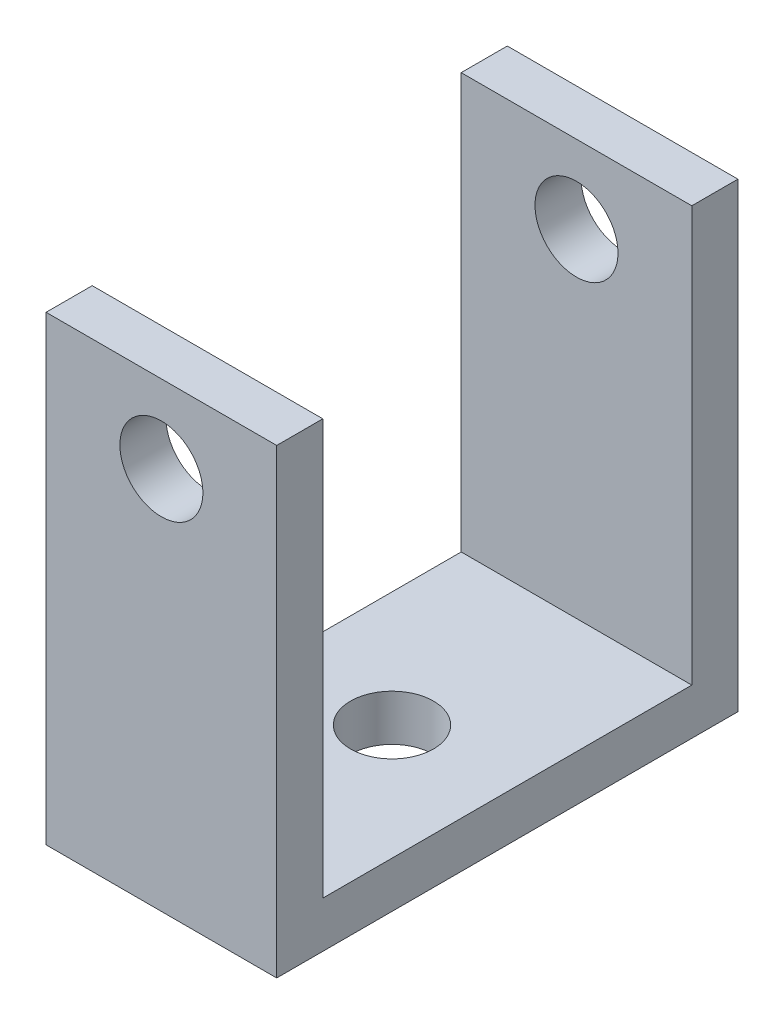
ISO-10303-21;
HEADER;
FILE_DESCRIPTION(('STEP AP214'),'2;1');
FILE_NAME('part.step','',(''),(''),'','','');
FILE_SCHEMA(('AUTOMOTIVE_DESIGN { 1 0 10303 214 1 1 1 1 }'));
ENDSEC;
DATA;
#1=APPLICATION_CONTEXT('core data for automotive mechanical design processes');
#2=APPLICATION_PROTOCOL_DEFINITION('international standard','automotive_design',2000,#1);
#3=PRODUCT_CONTEXT('',#1,'mechanical');
#4=PRODUCT('Part','Part','',(#3));
#5=PRODUCT_RELATED_PRODUCT_CATEGORY('part','',(#4));
#6=PRODUCT_DEFINITION_FORMATION('','',#4);
#7=PRODUCT_DEFINITION_CONTEXT('part definition',#1,'design');
#8=PRODUCT_DEFINITION('design','',#6,#7);
#9=PRODUCT_DEFINITION_SHAPE('','',#8);
#10=(LENGTH_UNIT() NAMED_UNIT(*) SI_UNIT(.MILLI.,.METRE.));
#11=(NAMED_UNIT(*) PLANE_ANGLE_UNIT() SI_UNIT($,.RADIAN.));
#12=(NAMED_UNIT(*) SI_UNIT($,.STERADIAN.) SOLID_ANGLE_UNIT());
#13=UNCERTAINTY_MEASURE_WITH_UNIT(LENGTH_MEASURE(1.E-05),#10,'distance_accuracy_value','');
#14=(GEOMETRIC_REPRESENTATION_CONTEXT(3) GLOBAL_UNCERTAINTY_ASSIGNED_CONTEXT((#13)) GLOBAL_UNIT_ASSIGNED_CONTEXT((#10,
#11,#12)) REPRESENTATION_CONTEXT('',''));
#15=CARTESIAN_POINT('',(0.,0.,0.));
#16=DIRECTION('',(0.,0.,1.));
#17=DIRECTION('',(1.,0.,0.));
#18=AXIS2_PLACEMENT_3D('',#15,#16,#17);
#19=CARTESIAN_POINT('',(6.35000000000003,0.,10.16));
#20=DIRECTION('',(0.,0.,1.));
#21=DIRECTION('',(0.,-1.,0.));
#22=AXIS2_PLACEMENT_3D('',#19,#20,#21);
#23=PLANE('',#22);
#24=CARTESIAN_POINT('',(0.,21.1074000000001,10.1599999999998));
#25=DIRECTION('',(0.,0.,1.));
#26=DIRECTION('',(0.,-1.,0.));
#27=AXIS2_PLACEMENT_3D('',#24,#25,#26);
#28=CIRCLE('',#27,2.286);
#29=CARTESIAN_POINT('',(0.,18.8214000000001,10.1599999999998));
#30=VERTEX_POINT('',#29);
#31=EDGE_CURVE('E136',#30,#30,#28,.T.);
#32=ORIENTED_EDGE('',*,*,#31,.T.);
#33=EDGE_LOOP('',(#32));
#34=FACE_BOUND('',#33,.T.);
#35=DIRECTION('',(0.,1.,0.));
#36=VECTOR('',#35,1.);
#37=CARTESIAN_POINT('',(-6.34999999999998,0.,10.16));
#38=LINE('',#37,#36);
#39=CARTESIAN_POINT('',(-6.35000000000001,2.54,10.16));
#40=VERTEX_POINT('',#39);
#41=CARTESIAN_POINT('',(-6.34999999999997,25.4000000000002,10.1599999999999));
#42=VERTEX_POINT('',#41);
#43=EDGE_CURVE('E132',#40,#42,#38,.T.);
#44=ORIENTED_EDGE('',*,*,#43,.T.);
#45=DIRECTION('',(-1.,0.,0.));
#46=VECTOR('',#45,1.);
#47=CARTESIAN_POINT('',(6.35000000000002,25.4000000000002,10.1599999999999));
#48=LINE('',#47,#46);
#49=CARTESIAN_POINT('',(6.35000000000002,25.4000000000002,10.1599999999999));
#50=VERTEX_POINT('',#49);
#51=EDGE_CURVE('E11',#50,#42,#48,.T.);
#52=ORIENTED_EDGE('',*,*,#51,.F.);
#53=DIRECTION('',(0.,1.,0.));
#54=VECTOR('',#53,1.);
#55=CARTESIAN_POINT('',(6.35000000000003,0.,10.16));
#56=LINE('',#55,#54);
#57=CARTESIAN_POINT('',(6.35000000000004,2.54000000000005,10.1599999999999));
#58=VERTEX_POINT('',#57);
#59=EDGE_CURVE('E90',#58,#50,#56,.T.);
#60=ORIENTED_EDGE('',*,*,#59,.F.);
#61=DIRECTION('',(-1.,0.,0.));
#62=VECTOR('',#61,1.);
#63=CARTESIAN_POINT('',(6.35000000000004,2.54000000000005,10.1599999999999));
#64=LINE('',#63,#62);
#65=EDGE_CURVE('E131',#58,#40,#64,.T.);
#66=ORIENTED_EDGE('',*,*,#65,.T.);
#67=EDGE_LOOP('',(#44,#52,#60,#66));
#68=FACE_BOUND('',#67,.T.);
#69=ADVANCED_FACE('F34',(#34,#68),#23,.F.);
#70=CARTESIAN_POINT('',(6.35000000000002,25.4000000000002,12.6999999999999));
#71=DIRECTION('',(0.,1.,0.));
#72=DIRECTION('',(0.,0.,1.));
#73=AXIS2_PLACEMENT_3D('',#70,#71,#72);
#74=PLANE('',#73);
#75=DIRECTION('',(0.,0.,-1.));
#76=VECTOR('',#75,1.);
#77=CARTESIAN_POINT('',(-6.35000000000002,25.4000000000002,12.6999999999999));
#78=LINE('',#77,#76);
#79=CARTESIAN_POINT('',(-6.35000000000002,25.4000000000002,12.6999999999999));
#80=VERTEX_POINT('',#79);
#81=EDGE_CURVE('E135',#80,#42,#78,.T.);
#82=ORIENTED_EDGE('',*,*,#81,.F.);
#83=DIRECTION('',(-1.,0.,0.));
#84=VECTOR('',#83,1.);
#85=CARTESIAN_POINT('',(6.35000000000002,25.4000000000002,12.6999999999999));
#86=LINE('',#85,#84);
#87=CARTESIAN_POINT('',(6.35000000000002,25.4000000000002,12.6999999999999));
#88=VERTEX_POINT('',#87);
#89=EDGE_CURVE('E43',#88,#80,#86,.T.);
#90=ORIENTED_EDGE('',*,*,#89,.F.);
#91=DIRECTION('',(0.,0.,-1.));
#92=VECTOR('',#91,1.);
#93=CARTESIAN_POINT('',(6.35000000000002,25.4000000000002,12.6999999999999));
#94=LINE('',#93,#92);
#95=EDGE_CURVE('E176',#88,#50,#94,.T.);
#96=ORIENTED_EDGE('',*,*,#95,.T.);
#97=ORIENTED_EDGE('',*,*,#51,.T.);
#98=EDGE_LOOP('',(#82,#90,#96,#97));
#99=FACE_BOUND('',#98,.T.);
#100=ADVANCED_FACE('F167',(#99),#74,.T.);
#101=CARTESIAN_POINT('',(6.34999999999999,0.,12.7));
#102=DIRECTION('',(0.,0.,1.));
#103=DIRECTION('',(0.,-1.,0.));
#104=AXIS2_PLACEMENT_3D('',#101,#102,#103);
#105=PLANE('',#104);
#106=CARTESIAN_POINT('',(0.,21.1074000000001,12.6999999999999));
#107=DIRECTION('',(0.,0.,1.));
#108=DIRECTION('',(0.,-1.,0.));
#109=AXIS2_PLACEMENT_3D('',#106,#107,#108);
#110=CIRCLE('',#109,2.286);
#111=CARTESIAN_POINT('',(0.,18.8214000000001,12.6999999999999));
#112=VERTEX_POINT('',#111);
#113=EDGE_CURVE('E183',#112,#112,#110,.T.);
#114=ORIENTED_EDGE('',*,*,#113,.F.);
#115=EDGE_LOOP('',(#114));
#116=FACE_BOUND('',#115,.T.);
#117=DIRECTION('',(0.,1.,0.));
#118=VECTOR('',#117,1.);
#119=CARTESIAN_POINT('',(-6.34999999999999,0.,12.7));
#120=LINE('',#119,#118);
#121=CARTESIAN_POINT('',(-6.34999999999999,0.,12.7));
#122=VERTEX_POINT('',#121);
#123=EDGE_CURVE('E139',#122,#80,#120,.T.);
#124=ORIENTED_EDGE('',*,*,#123,.F.);
#125=DIRECTION('',(-1.,0.,0.));
#126=VECTOR('',#125,1.);
#127=CARTESIAN_POINT('',(6.34999999999999,0.,12.7));
#128=LINE('',#127,#126);
#129=CARTESIAN_POINT('',(6.34999999999999,0.,12.7));
#130=VERTEX_POINT('',#129);
#131=EDGE_CURVE('E156',#130,#122,#128,.T.);
#132=ORIENTED_EDGE('',*,*,#131,.F.);
#133=DIRECTION('',(0.,1.,0.));
#134=VECTOR('',#133,1.);
#135=CARTESIAN_POINT('',(6.34999999999999,0.,12.7));
#136=LINE('',#135,#134);
#137=EDGE_CURVE('E164',#130,#88,#136,.T.);
#138=ORIENTED_EDGE('',*,*,#137,.T.);
#139=ORIENTED_EDGE('',*,*,#89,.T.);
#140=EDGE_LOOP('',(#124,#132,#138,#139));
#141=FACE_BOUND('',#140,.T.);
#142=ADVANCED_FACE('F162',(#116,#141),#105,.T.);
#143=CARTESIAN_POINT('',(6.34999999999999,0.,12.7));
#144=DIRECTION('',(0.,-1.00000000000001,0.));
#145=DIRECTION('',(0.,0.,-1.));
#146=AXIS2_PLACEMENT_3D('',#143,#144,#145);
#147=PLANE('',#146);
#148=CARTESIAN_POINT('',(0.,0.,0.));
#149=DIRECTION('',(0.,1.00000000000001,0.));
#150=DIRECTION('',(0.,0.,1.));
#151=AXIS2_PLACEMENT_3D('',#148,#149,#150);
#152=CIRCLE('',#151,2.286);
#153=CARTESIAN_POINT('',(0.,0.,2.286));
#154=VERTEX_POINT('',#153);
#155=EDGE_CURVE('E189',#154,#154,#152,.T.);
#156=ORIENTED_EDGE('',*,*,#155,.T.);
#157=EDGE_LOOP('',(#156));
#158=FACE_BOUND('',#157,.T.);
#159=DIRECTION('',(0.,0.,1.));
#160=VECTOR('',#159,1.);
#161=CARTESIAN_POINT('',(-6.34999999999999,0.,12.7));
#162=LINE('',#161,#160);
#163=CARTESIAN_POINT('',(-6.34999999999997,0.,-12.7));
#164=VERTEX_POINT('',#163);
#165=EDGE_CURVE('E142',#164,#122,#162,.T.);
#166=ORIENTED_EDGE('',*,*,#165,.F.);
#167=DIRECTION('',(-1.,0.,0.));
#168=VECTOR('',#167,1.);
#169=CARTESIAN_POINT('',(6.35000000000001,0.,-12.7));
#170=LINE('',#169,#168);
#171=CARTESIAN_POINT('',(6.35000000000001,0.,-12.7));
#172=VERTEX_POINT('',#171);
#173=EDGE_CURVE('E154',#172,#164,#170,.T.);
#174=ORIENTED_EDGE('',*,*,#173,.F.);
#175=DIRECTION('',(0.,0.,1.));
#176=VECTOR('',#175,1.);
#177=CARTESIAN_POINT('',(6.34999999999999,0.,12.7));
#178=LINE('',#177,#176);
#179=EDGE_CURVE('E126',#172,#130,#178,.T.);
#180=ORIENTED_EDGE('',*,*,#179,.T.);
#181=ORIENTED_EDGE('',*,*,#131,.T.);
#182=EDGE_LOOP('',(#166,#174,#180,#181));
#183=FACE_BOUND('',#182,.T.);
#184=ADVANCED_FACE('F174',(#158,#183),#147,.T.);
#185=CARTESIAN_POINT('',(6.35000000000001,0.,-12.7));
#186=DIRECTION('',(0.,0.,-1.));
#187=DIRECTION('',(0.,1.,0.));
#188=AXIS2_PLACEMENT_3D('',#185,#186,#187);
#189=PLANE('',#188);
#190=CARTESIAN_POINT('',(0.,21.1074000000002,-12.7000000000002));
#191=DIRECTION('',(0.,0.,1.));
#192=DIRECTION('',(1.,0.,0.));
#193=AXIS2_PLACEMENT_3D('',#190,#191,#192);
#194=CIRCLE('',#193,2.286);
#195=CARTESIAN_POINT('',(2.28599999999991,21.1074000000002,-12.7000000000002));
#196=VERTEX_POINT('',#195);
#197=EDGE_CURVE('E186',#196,#196,#194,.T.);
#198=ORIENTED_EDGE('',*,*,#197,.T.);
#199=EDGE_LOOP('',(#198));
#200=FACE_BOUND('',#199,.T.);
#201=DIRECTION('',(0.,-1.,0.));
#202=VECTOR('',#201,1.);
#203=CARTESIAN_POINT('',(-6.34999999999997,0.,-12.7));
#204=LINE('',#203,#202);
#205=CARTESIAN_POINT('',(-6.35000000000004,25.4000000000002,-12.7000000000002));
#206=VERTEX_POINT('',#205);
#207=EDGE_CURVE('E145',#206,#164,#204,.T.);
#208=ORIENTED_EDGE('',*,*,#207,.F.);
#209=DIRECTION('',(-1.,0.,0.));
#210=VECTOR('',#209,1.);
#211=CARTESIAN_POINT('',(6.34999999999993,25.4000000000003,-12.7000000000001));
#212=LINE('',#211,#210);
#213=CARTESIAN_POINT('',(6.34999999999993,25.4000000000003,-12.7000000000001));
#214=VERTEX_POINT('',#213);
#215=EDGE_CURVE('E114',#214,#206,#212,.T.);
#216=ORIENTED_EDGE('',*,*,#215,.F.);
#217=DIRECTION('',(0.,-1.,0.));
#218=VECTOR('',#217,1.);
#219=CARTESIAN_POINT('',(6.35000000000001,0.,-12.7));
#220=LINE('',#219,#218);
#221=EDGE_CURVE('E124',#214,#172,#220,.T.);
#222=ORIENTED_EDGE('',*,*,#221,.T.);
#223=ORIENTED_EDGE('',*,*,#173,.T.);
#224=EDGE_LOOP('',(#208,#216,#222,#223));
#225=FACE_BOUND('',#224,.T.);
#226=ADVANCED_FACE('F275',(#200,#225),#189,.T.);
#227=CARTESIAN_POINT('',(6.34999999999989,25.4000000000002,-10.1600000000001));
#228=DIRECTION('',(0.,1.,0.));
#229=DIRECTION('',(0.,0.,1.));
#230=AXIS2_PLACEMENT_3D('',#227,#228,#229);
#231=PLANE('',#230);
#232=DIRECTION('',(0.,0.,-1.));
#233=VECTOR('',#232,1.);
#234=CARTESIAN_POINT('',(-6.35000000000004,25.4000000000002,-10.1600000000002));
#235=LINE('',#234,#233);
#236=CARTESIAN_POINT('',(-6.35000000000004,25.4000000000002,-10.1600000000002));
#237=VERTEX_POINT('',#236);
#238=EDGE_CURVE('E113',#237,#206,#235,.T.);
#239=ORIENTED_EDGE('',*,*,#238,.F.);
#240=DIRECTION('',(-1.,0.,0.));
#241=VECTOR('',#240,1.);
#242=CARTESIAN_POINT('',(6.34999999999989,25.4000000000002,-10.1600000000001));
#243=LINE('',#242,#241);
#244=CARTESIAN_POINT('',(6.34999999999989,25.4000000000002,-10.1600000000001));
#245=VERTEX_POINT('',#244);
#246=EDGE_CURVE('E107',#245,#237,#243,.T.);
#247=ORIENTED_EDGE('',*,*,#246,.F.);
#248=DIRECTION('',(0.,0.,-1.));
#249=VECTOR('',#248,1.);
#250=CARTESIAN_POINT('',(6.34999999999989,25.4000000000002,-10.1600000000001));
#251=LINE('',#250,#249);
#252=EDGE_CURVE('E111',#245,#214,#251,.T.);
#253=ORIENTED_EDGE('',*,*,#252,.T.);
#254=ORIENTED_EDGE('',*,*,#215,.T.);
#255=EDGE_LOOP('',(#239,#247,#253,#254));
#256=FACE_BOUND('',#255,.T.);
#257=ADVANCED_FACE('F109',(#256),#231,.T.);
#258=CARTESIAN_POINT('',(6.35,1.2490009027033E-13,-10.16));
#259=DIRECTION('',(0.,0.,-1.));
#260=DIRECTION('',(0.,1.,0.));
#261=AXIS2_PLACEMENT_3D('',#258,#259,#260);
#262=PLANE('',#261);
#263=CARTESIAN_POINT('',(0.,21.1074000000002,-10.1600000000001));
#264=DIRECTION('',(0.,0.,-1.));
#265=DIRECTION('',(0.,1.,0.));
#266=AXIS2_PLACEMENT_3D('',#263,#264,#265);
#267=CIRCLE('',#266,2.286);
#268=CARTESIAN_POINT('',(0.,23.3934000000002,-10.1600000000001));
#269=VERTEX_POINT('',#268);
#270=EDGE_CURVE('E37',#269,#269,#267,.T.);
#271=ORIENTED_EDGE('',*,*,#270,.T.);
#272=EDGE_LOOP('',(#271));
#273=FACE_BOUND('',#272,.T.);
#274=DIRECTION('',(0.,-1.,0.));
#275=VECTOR('',#274,1.);
#276=CARTESIAN_POINT('',(-6.35000000000004,0.,-10.16));
#277=LINE('',#276,#275);
#278=CARTESIAN_POINT('',(-6.34999999999997,2.54000000000019,-10.16));
#279=VERTEX_POINT('',#278);
#280=EDGE_CURVE('E78',#237,#279,#277,.T.);
#281=ORIENTED_EDGE('',*,*,#280,.T.);
#282=DIRECTION('',(-1.,0.,0.));
#283=VECTOR('',#282,1.);
#284=CARTESIAN_POINT('',(6.35000000000004,2.54000000000018,-10.1600000000001));
#285=LINE('',#284,#283);
#286=CARTESIAN_POINT('',(6.35000000000004,2.54000000000018,-10.1600000000001));
#287=VERTEX_POINT('',#286);
#288=EDGE_CURVE('E115',#287,#279,#285,.T.);
#289=ORIENTED_EDGE('',*,*,#288,.F.);
#290=DIRECTION('',(0.,-1.,0.));
#291=VECTOR('',#290,1.);
#292=CARTESIAN_POINT('',(6.35,1.2490009027033E-13,-10.16));
#293=LINE('',#292,#291);
#294=EDGE_CURVE('E117',#245,#287,#293,.T.);
#295=ORIENTED_EDGE('',*,*,#294,.F.);
#296=ORIENTED_EDGE('',*,*,#246,.T.);
#297=EDGE_LOOP('',(#281,#289,#295,#296));
#298=FACE_BOUND('',#297,.T.);
#299=ADVANCED_FACE('F118',(#273,#298),#262,.F.);
#300=CARTESIAN_POINT('',(6.35000000000003,2.54000000000016,12.6999999999999));
#301=DIRECTION('',(0.,-1.00000000000001,0.));
#302=DIRECTION('',(0.,0.,-1.));
#303=AXIS2_PLACEMENT_3D('',#300,#301,#302);
#304=PLANE('',#303);
#305=CARTESIAN_POINT('',(0.,2.54000000000008,0.));
#306=DIRECTION('',(0.,1.00000000000001,0.));
#307=DIRECTION('',(0.,0.,1.));
#308=AXIS2_PLACEMENT_3D('',#305,#306,#307);
#309=CIRCLE('',#308,2.286);
#310=CARTESIAN_POINT('',(0.,2.54000000000007,2.28599999999999));
#311=VERTEX_POINT('',#310);
#312=EDGE_CURVE('E190',#311,#311,#309,.T.);
#313=ORIENTED_EDGE('',*,*,#312,.F.);
#314=EDGE_LOOP('',(#313));
#315=FACE_BOUND('',#314,.T.);
#316=DIRECTION('',(0.,0.,1.));
#317=VECTOR('',#316,1.);
#318=CARTESIAN_POINT('',(-6.34999999999999,2.54,12.7));
#319=LINE('',#318,#317);
#320=EDGE_CURVE('E84',#279,#40,#319,.T.);
#321=ORIENTED_EDGE('',*,*,#320,.T.);
#322=ORIENTED_EDGE('',*,*,#65,.F.);
#323=DIRECTION('',(0.,0.,1.));
#324=VECTOR('',#323,1.);
#325=CARTESIAN_POINT('',(6.35000000000003,2.54000000000016,12.6999999999999));
#326=LINE('',#325,#324);
#327=EDGE_CURVE('E51',#287,#58,#326,.T.);
#328=ORIENTED_EDGE('',*,*,#327,.F.);
#329=ORIENTED_EDGE('',*,*,#288,.T.);
#330=EDGE_LOOP('',(#321,#322,#328,#329));
#331=FACE_BOUND('',#330,.T.);
#332=ADVANCED_FACE('F204',(#315,#331),#304,.F.);
#333=CARTESIAN_POINT('',(6.35000000000005,1.45716771982052E-13,0.));
#334=DIRECTION('',(-1.,0.,0.));
#335=DIRECTION('',(0.,0.,1.));
#336=AXIS2_PLACEMENT_3D('',#333,#334,#335);
#337=PLANE('',#336);
#338=ORIENTED_EDGE('',*,*,#59,.T.);
#339=ORIENTED_EDGE('',*,*,#95,.F.);
#340=ORIENTED_EDGE('',*,*,#137,.F.);
#341=ORIENTED_EDGE('',*,*,#179,.F.);
#342=ORIENTED_EDGE('',*,*,#221,.F.);
#343=ORIENTED_EDGE('',*,*,#252,.F.);
#344=ORIENTED_EDGE('',*,*,#294,.T.);
#345=ORIENTED_EDGE('',*,*,#327,.T.);
#346=EDGE_LOOP('',(#338,#339,#340,#341,#342,#343,#344,#345));
#347=FACE_BOUND('',#346,.T.);
#348=ADVANCED_FACE('F121',(#347),#337,.F.);
#349=CARTESIAN_POINT('',(-6.34999999999993,1.31838984174237E-13,0.));
#350=DIRECTION('',(-1.,0.,0.));
#351=DIRECTION('',(0.,0.,1.));
#352=AXIS2_PLACEMENT_3D('',#349,#350,#351);
#353=PLANE('',#352);
#354=ORIENTED_EDGE('',*,*,#43,.F.);
#355=ORIENTED_EDGE('',*,*,#320,.F.);
#356=ORIENTED_EDGE('',*,*,#280,.F.);
#357=ORIENTED_EDGE('',*,*,#238,.T.);
#358=ORIENTED_EDGE('',*,*,#207,.T.);
#359=ORIENTED_EDGE('',*,*,#165,.T.);
#360=ORIENTED_EDGE('',*,*,#123,.T.);
#361=ORIENTED_EDGE('',*,*,#81,.T.);
#362=EDGE_LOOP('',(#354,#355,#356,#357,#358,#359,#360,#361));
#363=FACE_BOUND('',#362,.T.);
#364=ADVANCED_FACE('F170',(#363),#353,.T.);
#365=CARTESIAN_POINT('',(0.,21.1074000000002,-12.7000000000002));
#366=DIRECTION('',(0.,0.,1.));
#367=DIRECTION('',(1.,0.,0.));
#368=AXIS2_PLACEMENT_3D('',#365,#366,#367);
#369=CYLINDRICAL_SURFACE('',#368,2.286);
#370=ORIENTED_EDGE('',*,*,#197,.F.);
#371=EDGE_LOOP('',(#370));
#372=FACE_BOUND('',#371,.T.);
#373=ORIENTED_EDGE('',*,*,#270,.F.);
#374=EDGE_LOOP('',(#373));
#375=FACE_BOUND('',#374,.T.);
#376=ADVANCED_FACE('F224',(#372,#375),#369,.F.);
#377=ORIENTED_EDGE('',*,*,#113,.T.);
#378=EDGE_LOOP('',(#377));
#379=FACE_BOUND('',#378,.T.);
#380=ORIENTED_EDGE('',*,*,#31,.F.);
#381=EDGE_LOOP('',(#380));
#382=FACE_BOUND('',#381,.T.);
#383=ADVANCED_FACE('F200',(#379,#382),#369,.F.);
#384=CARTESIAN_POINT('',(0.,0.,0.));
#385=DIRECTION('',(0.,1.00000000000001,0.));
#386=DIRECTION('',(0.,0.,1.));
#387=AXIS2_PLACEMENT_3D('',#384,#385,#386);
#388=CYLINDRICAL_SURFACE('',#387,2.286);
#389=ORIENTED_EDGE('',*,*,#155,.F.);
#390=EDGE_LOOP('',(#389));
#391=FACE_BOUND('',#390,.T.);
#392=ORIENTED_EDGE('',*,*,#312,.T.);
#393=EDGE_LOOP('',(#392));
#394=FACE_BOUND('',#393,.T.);
#395=ADVANCED_FACE('F197',(#391,#394),#388,.F.);
#396=CLOSED_SHELL('',(#69,#100,#142,#184,#226,#257,#299,#332,#348,#364,#376,#383,#395));
#397=MANIFOLD_SOLID_BREP('B2',#396);
#398=ADVANCED_BREP_SHAPE_REPRESENTATION('',(#18,#397),#14);
#399=SHAPE_DEFINITION_REPRESENTATION(#9,#398);
ENDSEC;
END-ISO-10303-21;
